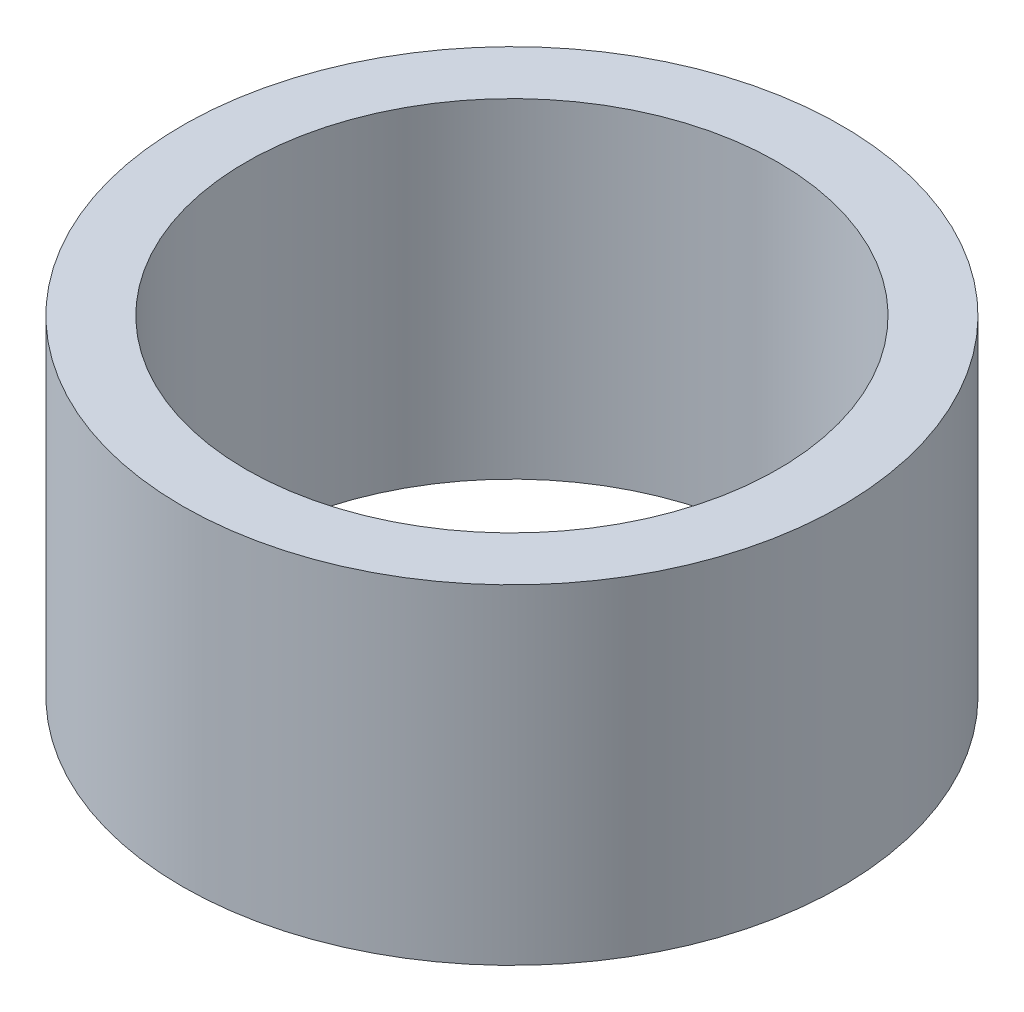
ISO-10303-21;
HEADER;
FILE_DESCRIPTION(('STEP AP214'),'2;1');
FILE_NAME('part.step','',(''),(''),'','','');
FILE_SCHEMA(('AUTOMOTIVE_DESIGN { 1 0 10303 214 1 1 1 1 }'));
ENDSEC;
DATA;
#1=APPLICATION_CONTEXT('core data for automotive mechanical design processes');
#2=APPLICATION_PROTOCOL_DEFINITION('international standard','automotive_design',2000,#1);
#3=PRODUCT_CONTEXT('',#1,'mechanical');
#4=PRODUCT('Part','Part','',(#3));
#5=PRODUCT_RELATED_PRODUCT_CATEGORY('part','',(#4));
#6=PRODUCT_DEFINITION_FORMATION('','',#4);
#7=PRODUCT_DEFINITION_CONTEXT('part definition',#1,'design');
#8=PRODUCT_DEFINITION('design','',#6,#7);
#9=PRODUCT_DEFINITION_SHAPE('','',#8);
#10=(LENGTH_UNIT() NAMED_UNIT(*) SI_UNIT(.MILLI.,.METRE.));
#11=(NAMED_UNIT(*) PLANE_ANGLE_UNIT() SI_UNIT($,.RADIAN.));
#12=(NAMED_UNIT(*) SI_UNIT($,.STERADIAN.) SOLID_ANGLE_UNIT());
#13=UNCERTAINTY_MEASURE_WITH_UNIT(LENGTH_MEASURE(1.E-05),#10,'distance_accuracy_value','');
#14=(GEOMETRIC_REPRESENTATION_CONTEXT(3) GLOBAL_UNCERTAINTY_ASSIGNED_CONTEXT((#13)) GLOBAL_UNIT_ASSIGNED_CONTEXT((#10,
#11,#12)) REPRESENTATION_CONTEXT('',''));
#15=CARTESIAN_POINT('',(0.,0.,0.));
#16=DIRECTION('',(0.,0.,1.));
#17=DIRECTION('',(1.,0.,0.));
#18=AXIS2_PLACEMENT_3D('',#15,#16,#17);
#19=CARTESIAN_POINT('',(20.5,0.,0.));
#20=DIRECTION('',(0.,1.,0.));
#21=DIRECTION('',(0.,0.,1.));
#22=AXIS2_PLACEMENT_3D('',#19,#20,#21);
#23=PLANE('',#22);
#24=CARTESIAN_POINT('',(0.,0.,0.));
#25=DIRECTION('',(0.,1.,0.));
#26=DIRECTION('',(0.,0.,1.));
#27=AXIS2_PLACEMENT_3D('',#24,#25,#26);
#28=CIRCLE('',#27,25.4);
#29=CARTESIAN_POINT('',(0.,0.,25.4));
#30=VERTEX_POINT('',#29);
#31=EDGE_CURVE('E10',#30,#30,#28,.T.);
#32=ORIENTED_EDGE('',*,*,#31,.F.);
#33=EDGE_LOOP('',(#32));
#34=FACE_BOUND('',#33,.T.);
#35=CARTESIAN_POINT('',(0.,0.,0.));
#36=DIRECTION('',(0.,1.,0.));
#37=DIRECTION('',(0.,0.,1.));
#38=AXIS2_PLACEMENT_3D('',#35,#36,#37);
#39=CIRCLE('',#38,20.5);
#40=CARTESIAN_POINT('',(0.,0.,20.5));
#41=VERTEX_POINT('',#40);
#42=EDGE_CURVE('E51',#41,#41,#39,.T.);
#43=ORIENTED_EDGE('',*,*,#42,.T.);
#44=EDGE_LOOP('',(#43));
#45=FACE_BOUND('',#44,.T.);
#46=ADVANCED_FACE('F37',(#34,#45),#23,.F.);
#47=CARTESIAN_POINT('',(0.,161.376166943427,0.));
#48=DIRECTION('',(0.,1.,0.));
#49=DIRECTION('',(0.,0.,1.));
#50=AXIS2_PLACEMENT_3D('',#47,#48,#49);
#51=CYLINDRICAL_SURFACE('',#50,25.4);
#52=CARTESIAN_POINT('',(0.,25.4,0.));
#53=DIRECTION('',(0.,1.,0.));
#54=DIRECTION('',(0.,0.,1.));
#55=AXIS2_PLACEMENT_3D('',#52,#53,#54);
#56=CIRCLE('',#55,25.4);
#57=CARTESIAN_POINT('',(0.,25.4,25.4));
#58=VERTEX_POINT('',#57);
#59=EDGE_CURVE('E43',#58,#58,#56,.T.);
#60=ORIENTED_EDGE('',*,*,#59,.F.);
#61=EDGE_LOOP('',(#60));
#62=FACE_BOUND('',#61,.T.);
#63=ORIENTED_EDGE('',*,*,#31,.T.);
#64=EDGE_LOOP('',(#63));
#65=FACE_BOUND('',#64,.T.);
#66=ADVANCED_FACE('F66',(#62,#65),#51,.T.);
#67=CARTESIAN_POINT('',(20.5,25.4,0.));
#68=DIRECTION('',(0.,-1.,0.));
#69=DIRECTION('',(0.,0.,-1.));
#70=AXIS2_PLACEMENT_3D('',#67,#68,#69);
#71=PLANE('',#70);
#72=CARTESIAN_POINT('',(0.,25.4,0.));
#73=DIRECTION('',(0.,1.,0.));
#74=DIRECTION('',(0.,0.,1.));
#75=AXIS2_PLACEMENT_3D('',#72,#73,#74);
#76=CIRCLE('',#75,20.5);
#77=CARTESIAN_POINT('',(0.,25.4,20.5));
#78=VERTEX_POINT('',#77);
#79=EDGE_CURVE('E47',#78,#78,#76,.T.);
#80=ORIENTED_EDGE('',*,*,#79,.F.);
#81=EDGE_LOOP('',(#80));
#82=FACE_BOUND('',#81,.T.);
#83=ORIENTED_EDGE('',*,*,#59,.T.);
#84=EDGE_LOOP('',(#83));
#85=FACE_BOUND('',#84,.T.);
#86=ADVANCED_FACE('F61',(#82,#85),#71,.F.);
#87=CARTESIAN_POINT('',(0.,161.376166943427,0.));
#88=DIRECTION('',(0.,1.,0.));
#89=DIRECTION('',(0.,0.,1.));
#90=AXIS2_PLACEMENT_3D('',#87,#88,#89);
#91=CYLINDRICAL_SURFACE('',#90,20.5);
#92=ORIENTED_EDGE('',*,*,#42,.F.);
#93=EDGE_LOOP('',(#92));
#94=FACE_BOUND('',#93,.T.);
#95=ORIENTED_EDGE('',*,*,#79,.T.);
#96=EDGE_LOOP('',(#95));
#97=FACE_BOUND('',#96,.T.);
#98=ADVANCED_FACE('F58',(#94,#97),#91,.F.);
#99=CLOSED_SHELL('',(#46,#66,#86,#98));
#100=MANIFOLD_SOLID_BREP('B2',#99);
#101=ADVANCED_BREP_SHAPE_REPRESENTATION('',(#18,#100),#14);
#102=SHAPE_DEFINITION_REPRESENTATION(#9,#101);
ENDSEC;
END-ISO-10303-21;
